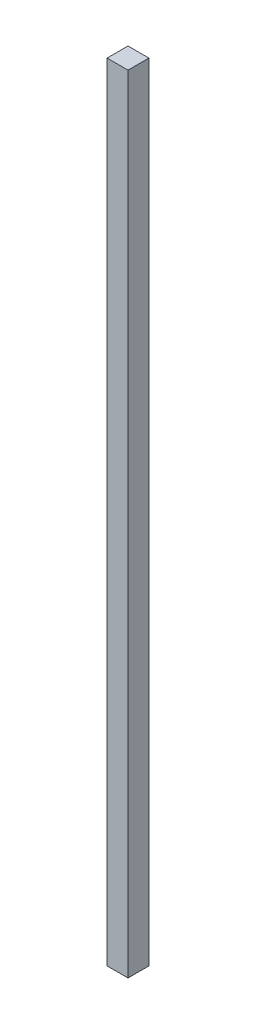
ISO-10303-21;
HEADER;
FILE_DESCRIPTION(('STEP AP214'),'2;1');
FILE_NAME('part.step','',(''),(''),'','','');
FILE_SCHEMA(('AUTOMOTIVE_DESIGN { 1 0 10303 214 1 1 1 1 }'));
ENDSEC;
DATA;
#1=APPLICATION_CONTEXT('core data for automotive mechanical design processes');
#2=APPLICATION_PROTOCOL_DEFINITION('international standard','automotive_design',2000,#1);
#3=PRODUCT_CONTEXT('',#1,'mechanical');
#4=PRODUCT('Part','Part','',(#3));
#5=PRODUCT_RELATED_PRODUCT_CATEGORY('part','',(#4));
#6=PRODUCT_DEFINITION_FORMATION('','',#4);
#7=PRODUCT_DEFINITION_CONTEXT('part definition',#1,'design');
#8=PRODUCT_DEFINITION('design','',#6,#7);
#9=PRODUCT_DEFINITION_SHAPE('','',#8);
#10=(LENGTH_UNIT() NAMED_UNIT(*) SI_UNIT(.MILLI.,.METRE.));
#11=(NAMED_UNIT(*) PLANE_ANGLE_UNIT() SI_UNIT($,.RADIAN.));
#12=(NAMED_UNIT(*) SI_UNIT($,.STERADIAN.) SOLID_ANGLE_UNIT());
#13=UNCERTAINTY_MEASURE_WITH_UNIT(LENGTH_MEASURE(1.E-05),#10,'distance_accuracy_value','');
#14=(GEOMETRIC_REPRESENTATION_CONTEXT(3) GLOBAL_UNCERTAINTY_ASSIGNED_CONTEXT((#13)) GLOBAL_UNIT_ASSIGNED_CONTEXT((#10,
#11,#12)) REPRESENTATION_CONTEXT('',''));
#15=CARTESIAN_POINT('',(0.,0.,0.));
#16=DIRECTION('',(0.,0.,1.));
#17=DIRECTION('',(1.,0.,0.));
#18=AXIS2_PLACEMENT_3D('',#15,#16,#17);
#19=CARTESIAN_POINT('',(-39.8355089835924,955.,-18.6136158048334));
#20=DIRECTION('',(1.,0.,0.));
#21=DIRECTION('',(0.,0.,-1.));
#22=AXIS2_PLACEMENT_3D('',#19,#20,#21);
#23=PLANE('',#22);
#24=DIRECTION('',(0.,0.,1.));
#25=VECTOR('',#24,1.);
#26=CARTESIAN_POINT('',(-39.8355089835924,0.,-18.6136158048334));
#27=LINE('',#26,#25);
#28=CARTESIAN_POINT('',(-39.8355089835924,0.,-18.6136158048334));
#29=VERTEX_POINT('',#28);
#30=CARTESIAN_POINT('',(-39.8355089835924,0.,6.78638419516663));
#31=VERTEX_POINT('',#30);
#32=EDGE_CURVE('E94',#29,#31,#27,.T.);
#33=ORIENTED_EDGE('',*,*,#32,.T.);
#34=DIRECTION('',(0.,-1.,0.));
#35=VECTOR('',#34,1.);
#36=CARTESIAN_POINT('',(-39.8355089835924,955.,6.78638419516663));
#37=LINE('',#36,#35);
#38=CARTESIAN_POINT('',(-39.8355089835924,955.,6.78638419516663));
#39=VERTEX_POINT('',#38);
#40=EDGE_CURVE('E11',#39,#31,#37,.T.);
#41=ORIENTED_EDGE('',*,*,#40,.F.);
#42=DIRECTION('',(0.,0.,1.));
#43=VECTOR('',#42,1.);
#44=CARTESIAN_POINT('',(-39.8355089835924,955.,-18.6136158048334));
#45=LINE('',#44,#43);
#46=CARTESIAN_POINT('',(-39.8355089835924,955.,-18.6136158048334));
#47=VERTEX_POINT('',#46);
#48=EDGE_CURVE('E82',#47,#39,#45,.T.);
#49=ORIENTED_EDGE('',*,*,#48,.F.);
#50=DIRECTION('',(0.,-1.,0.));
#51=VECTOR('',#50,1.);
#52=CARTESIAN_POINT('',(-39.8355089835924,955.,-18.6136158048334));
#53=LINE('',#52,#51);
#54=EDGE_CURVE('E90',#47,#29,#53,.T.);
#55=ORIENTED_EDGE('',*,*,#54,.T.);
#56=EDGE_LOOP('',(#33,#41,#49,#55));
#57=FACE_BOUND('',#56,.T.);
#58=ADVANCED_FACE('F31',(#57),#23,.F.);
#59=CARTESIAN_POINT('',(-39.8355089835924,955.,6.78638419516663));
#60=DIRECTION('',(0.,0.,-1.));
#61=DIRECTION('',(-1.,0.,0.));
#62=AXIS2_PLACEMENT_3D('',#59,#60,#61);
#63=PLANE('',#62);
#64=DIRECTION('',(1.,0.,0.));
#65=VECTOR('',#64,1.);
#66=CARTESIAN_POINT('',(-39.8355089835924,0.,6.78638419516663));
#67=LINE('',#66,#65);
#68=CARTESIAN_POINT('',(-14.4355089835924,0.,6.78638419516663));
#69=VERTEX_POINT('',#68);
#70=EDGE_CURVE('E86',#31,#69,#67,.T.);
#71=ORIENTED_EDGE('',*,*,#70,.T.);
#72=DIRECTION('',(0.,-1.,0.));
#73=VECTOR('',#72,1.);
#74=CARTESIAN_POINT('',(-14.4355089835924,955.,6.78638419516663));
#75=LINE('',#74,#73);
#76=CARTESIAN_POINT('',(-14.4355089835924,955.,6.78638419516663));
#77=VERTEX_POINT('',#76);
#78=EDGE_CURVE('E39',#77,#69,#75,.T.);
#79=ORIENTED_EDGE('',*,*,#78,.F.);
#80=DIRECTION('',(1.,0.,0.));
#81=VECTOR('',#80,1.);
#82=CARTESIAN_POINT('',(-39.8355089835924,955.,6.78638419516663));
#83=LINE('',#82,#81);
#84=EDGE_CURVE('E77',#39,#77,#83,.T.);
#85=ORIENTED_EDGE('',*,*,#84,.F.);
#86=ORIENTED_EDGE('',*,*,#40,.T.);
#87=EDGE_LOOP('',(#71,#79,#85,#86));
#88=FACE_BOUND('',#87,.T.);
#89=ADVANCED_FACE('F85',(#88),#63,.F.);
#90=CARTESIAN_POINT('',(-14.4355089835924,955.,-18.6136158048334));
#91=DIRECTION('',(-1.,0.,0.));
#92=DIRECTION('',(0.,0.,1.));
#93=AXIS2_PLACEMENT_3D('',#90,#91,#92);
#94=PLANE('',#93);
#95=DIRECTION('',(0.,0.,-1.));
#96=VECTOR('',#95,1.);
#97=CARTESIAN_POINT('',(-14.4355089835924,0.,-18.6136158048334));
#98=LINE('',#97,#96);
#99=CARTESIAN_POINT('',(-14.4355089835924,0.,-18.6136158048334));
#100=VERTEX_POINT('',#99);
#101=EDGE_CURVE('E64',#69,#100,#98,.T.);
#102=ORIENTED_EDGE('',*,*,#101,.T.);
#103=DIRECTION('',(0.,-1.,0.));
#104=VECTOR('',#103,1.);
#105=CARTESIAN_POINT('',(-14.4355089835924,955.,-18.6136158048334));
#106=LINE('',#105,#104);
#107=CARTESIAN_POINT('',(-14.4355089835924,955.,-18.6136158048334));
#108=VERTEX_POINT('',#107);
#109=EDGE_CURVE('E87',#108,#100,#106,.T.);
#110=ORIENTED_EDGE('',*,*,#109,.F.);
#111=DIRECTION('',(0.,0.,-1.));
#112=VECTOR('',#111,1.);
#113=CARTESIAN_POINT('',(-14.4355089835924,955.,-18.6136158048334));
#114=LINE('',#113,#112);
#115=EDGE_CURVE('E80',#77,#108,#114,.T.);
#116=ORIENTED_EDGE('',*,*,#115,.F.);
#117=ORIENTED_EDGE('',*,*,#78,.T.);
#118=EDGE_LOOP('',(#102,#110,#116,#117));
#119=FACE_BOUND('',#118,.T.);
#120=ADVANCED_FACE('F88',(#119),#94,.F.);
#121=CARTESIAN_POINT('',(-39.8355089835924,955.,-18.6136158048334));
#122=DIRECTION('',(0.,0.,1.));
#123=DIRECTION('',(1.,0.,0.));
#124=AXIS2_PLACEMENT_3D('',#121,#122,#123);
#125=PLANE('',#124);
#126=DIRECTION('',(-1.,0.,0.));
#127=VECTOR('',#126,1.);
#128=CARTESIAN_POINT('',(-39.8355089835924,0.,-18.6136158048334));
#129=LINE('',#128,#127);
#130=EDGE_CURVE('E70',#100,#29,#129,.T.);
#131=ORIENTED_EDGE('',*,*,#130,.T.);
#132=ORIENTED_EDGE('',*,*,#54,.F.);
#133=DIRECTION('',(-1.,0.,0.));
#134=VECTOR('',#133,1.);
#135=CARTESIAN_POINT('',(-39.8355089835924,955.,-18.6136158048334));
#136=LINE('',#135,#134);
#137=EDGE_CURVE('E47',#108,#47,#136,.T.);
#138=ORIENTED_EDGE('',*,*,#137,.F.);
#139=ORIENTED_EDGE('',*,*,#109,.T.);
#140=EDGE_LOOP('',(#131,#132,#138,#139));
#141=FACE_BOUND('',#140,.T.);
#142=ADVANCED_FACE('F101',(#141),#125,.F.);
#143=CARTESIAN_POINT('',(-39.8355089835924,955.,6.78638419516663));
#144=DIRECTION('',(0.,1.,0.));
#145=DIRECTION('',(0.,0.,1.));
#146=AXIS2_PLACEMENT_3D('',#143,#144,#145);
#147=PLANE('',#146);
#148=ORIENTED_EDGE('',*,*,#48,.T.);
#149=ORIENTED_EDGE('',*,*,#84,.T.);
#150=ORIENTED_EDGE('',*,*,#115,.T.);
#151=ORIENTED_EDGE('',*,*,#137,.T.);
#152=EDGE_LOOP('',(#148,#149,#150,#151));
#153=FACE_BOUND('',#152,.T.);
#154=ADVANCED_FACE('F78',(#153),#147,.T.);
#155=CARTESIAN_POINT('',(-39.8355089835924,0.,6.78638419516663));
#156=DIRECTION('',(0.,1.,0.));
#157=DIRECTION('',(0.,0.,1.));
#158=AXIS2_PLACEMENT_3D('',#155,#156,#157);
#159=PLANE('',#158);
#160=ORIENTED_EDGE('',*,*,#32,.F.);
#161=ORIENTED_EDGE('',*,*,#130,.F.);
#162=ORIENTED_EDGE('',*,*,#101,.F.);
#163=ORIENTED_EDGE('',*,*,#70,.F.);
#164=EDGE_LOOP('',(#160,#161,#162,#163));
#165=FACE_BOUND('',#164,.T.);
#166=ADVANCED_FACE('F104',(#165),#159,.F.);
#167=CLOSED_SHELL('',(#58,#89,#120,#142,#154,#166));
#168=MANIFOLD_SOLID_BREP('B2',#167);
#169=ADVANCED_BREP_SHAPE_REPRESENTATION('',(#18,#168),#14);
#170=SHAPE_DEFINITION_REPRESENTATION(#9,#169);
ENDSEC;
END-ISO-10303-21;
